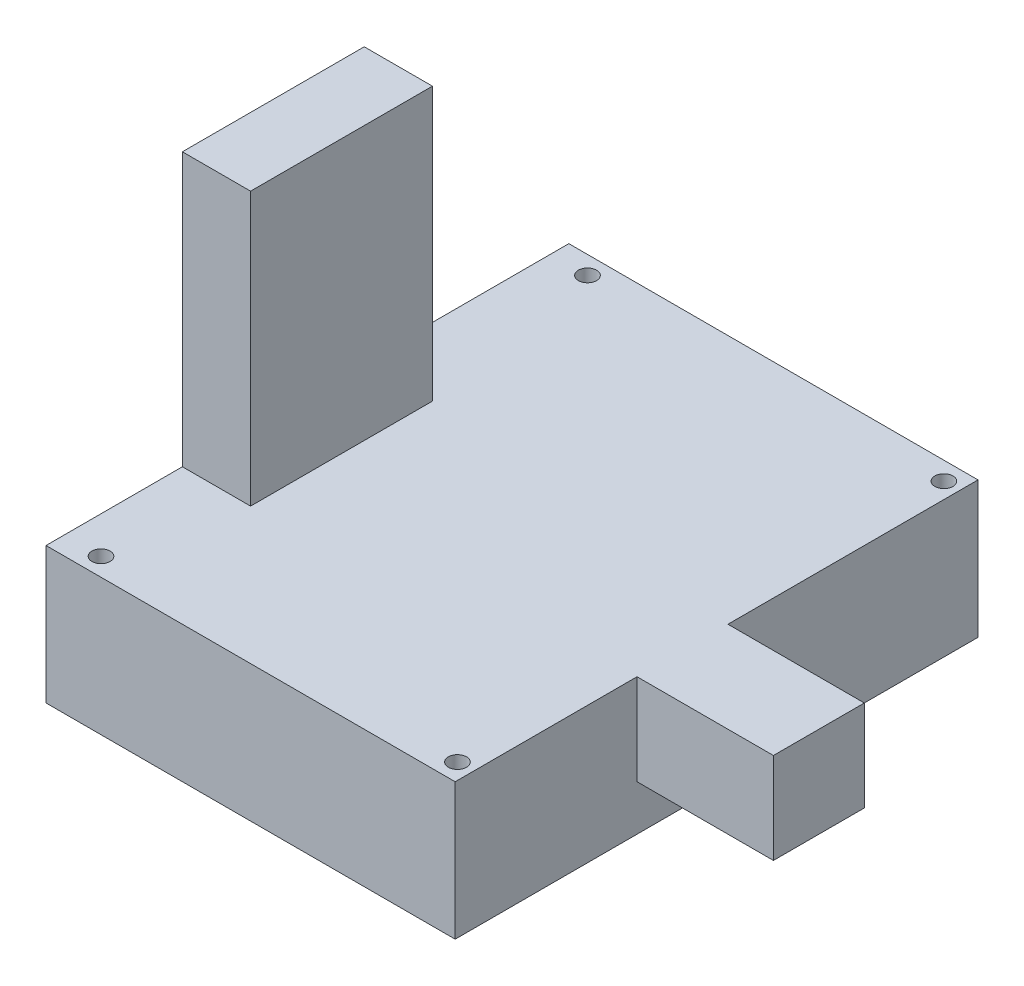
ISO-10303-21;
HEADER;
FILE_DESCRIPTION(('STEP AP214'),'2;1');
FILE_NAME('part.step','',(''),(''),'','','');
FILE_SCHEMA(('AUTOMOTIVE_DESIGN { 1 0 10303 214 1 1 1 1 }'));
ENDSEC;
DATA;
#1=APPLICATION_CONTEXT('core data for automotive mechanical design processes');
#2=APPLICATION_PROTOCOL_DEFINITION('international standard','automotive_design',2000,#1);
#3=PRODUCT_CONTEXT('',#1,'mechanical');
#4=PRODUCT('Part','Part','',(#3));
#5=PRODUCT_RELATED_PRODUCT_CATEGORY('part','',(#4));
#6=PRODUCT_DEFINITION_FORMATION('','',#4);
#7=PRODUCT_DEFINITION_CONTEXT('part definition',#1,'design');
#8=PRODUCT_DEFINITION('design','',#6,#7);
#9=PRODUCT_DEFINITION_SHAPE('','',#8);
#10=(LENGTH_UNIT() NAMED_UNIT(*) SI_UNIT(.MILLI.,.METRE.));
#11=(NAMED_UNIT(*) PLANE_ANGLE_UNIT() SI_UNIT($,.RADIAN.));
#12=(NAMED_UNIT(*) SI_UNIT($,.STERADIAN.) SOLID_ANGLE_UNIT());
#13=UNCERTAINTY_MEASURE_WITH_UNIT(LENGTH_MEASURE(1.E-05),#10,'distance_accuracy_value','');
#14=(GEOMETRIC_REPRESENTATION_CONTEXT(3) GLOBAL_UNCERTAINTY_ASSIGNED_CONTEXT((#13)) GLOBAL_UNIT_ASSIGNED_CONTEXT((#10,
#11,#12)) REPRESENTATION_CONTEXT('',''));
#15=CARTESIAN_POINT('',(0.,0.,0.));
#16=DIRECTION('',(0.,0.,1.));
#17=DIRECTION('',(1.,0.,0.));
#18=AXIS2_PLACEMENT_3D('',#15,#16,#17);
#19=CARTESIAN_POINT('',(-45.,30.,115.));
#20=DIRECTION('',(0.,-1.,0.));
#21=DIRECTION('',(1.,0.,0.));
#22=AXIS2_PLACEMENT_3D('',#19,#20,#21);
#23=PLANE('',#22);
#24=CARTESIAN_POINT('',(41.5,30.,111.));
#25=DIRECTION('',(0.,-1.,0.));
#26=DIRECTION('',(1.,0.,0.));
#27=AXIS2_PLACEMENT_3D('',#24,#25,#26);
#28=CIRCLE('',#27,2.);
#29=CARTESIAN_POINT('',(43.5,30.,111.));
#30=VERTEX_POINT('',#29);
#31=EDGE_CURVE('E268',#30,#30,#28,.F.);
#32=ORIENTED_EDGE('',*,*,#31,.F.);
#33=EDGE_LOOP('',(#32));
#34=FACE_BOUND('',#33,.T.);
#35=CARTESIAN_POINT('',(-36.9,30.,111.));
#36=DIRECTION('',(0.,-1.,0.));
#37=DIRECTION('',(1.,0.,0.));
#38=AXIS2_PLACEMENT_3D('',#35,#36,#37);
#39=CIRCLE('',#38,2.);
#40=CARTESIAN_POINT('',(-34.9,30.,111.));
#41=VERTEX_POINT('',#40);
#42=EDGE_CURVE('E275',#41,#41,#39,.F.);
#43=ORIENTED_EDGE('',*,*,#42,.F.);
#44=EDGE_LOOP('',(#43));
#45=FACE_BOUND('',#44,.T.);
#46=CARTESIAN_POINT('',(-36.9,30.,4.));
#47=DIRECTION('',(0.,-1.,0.));
#48=DIRECTION('',(1.,0.,0.));
#49=AXIS2_PLACEMENT_3D('',#46,#47,#48);
#50=CIRCLE('',#49,2.);
#51=CARTESIAN_POINT('',(-34.9,30.,4.));
#52=VERTEX_POINT('',#51);
#53=EDGE_CURVE('E279',#52,#52,#50,.F.);
#54=ORIENTED_EDGE('',*,*,#53,.F.);
#55=EDGE_LOOP('',(#54));
#56=FACE_BOUND('',#55,.T.);
#57=CARTESIAN_POINT('',(41.5,30.,4.));
#58=DIRECTION('',(0.,-1.,0.));
#59=DIRECTION('',(1.,0.,0.));
#60=AXIS2_PLACEMENT_3D('',#57,#58,#59);
#61=CIRCLE('',#60,1.99999999999998);
#62=CARTESIAN_POINT('',(43.5,30.,4.));
#63=VERTEX_POINT('',#62);
#64=EDGE_CURVE('E283',#63,#63,#61,.F.);
#65=ORIENTED_EDGE('',*,*,#64,.F.);
#66=EDGE_LOOP('',(#65));
#67=FACE_BOUND('',#66,.T.);
#68=DIRECTION('',(-1.,0.,0.));
#69=VECTOR('',#68,1.);
#70=CARTESIAN_POINT('',(-45.,30.,45.));
#71=LINE('',#70,#69);
#72=CARTESIAN_POINT('',(-30.,30.,45.));
#73=VERTEX_POINT('',#72);
#74=CARTESIAN_POINT('',(-45.,30.,45.));
#75=VERTEX_POINT('',#74);
#76=EDGE_CURVE('E54',#73,#75,#71,.T.);
#77=ORIENTED_EDGE('',*,*,#76,.F.);
#78=DIRECTION('',(0.,0.,-1.));
#79=VECTOR('',#78,1.);
#80=CARTESIAN_POINT('',(-30.,30.,45.));
#81=LINE('',#80,#79);
#82=CARTESIAN_POINT('',(-30.,30.,85.));
#83=VERTEX_POINT('',#82);
#84=EDGE_CURVE('E263',#83,#73,#81,.T.);
#85=ORIENTED_EDGE('',*,*,#84,.F.);
#86=DIRECTION('',(1.,0.,0.));
#87=VECTOR('',#86,1.);
#88=CARTESIAN_POINT('',(-45.,30.,85.));
#89=LINE('',#88,#87);
#90=CARTESIAN_POINT('',(-45.,30.,85.));
#91=VERTEX_POINT('',#90);
#92=EDGE_CURVE('E266',#91,#83,#89,.T.);
#93=ORIENTED_EDGE('',*,*,#92,.F.);
#94=DIRECTION('',(0.,0.,-1.));
#95=VECTOR('',#94,1.);
#96=CARTESIAN_POINT('',(-45.,30.,115.));
#97=LINE('',#96,#95);
#98=CARTESIAN_POINT('',(-45.,30.,115.));
#99=VERTEX_POINT('',#98);
#100=EDGE_CURVE('E153',#99,#91,#97,.T.);
#101=ORIENTED_EDGE('',*,*,#100,.F.);
#102=DIRECTION('',(-1.,0.,0.));
#103=VECTOR('',#102,1.);
#104=CARTESIAN_POINT('',(-45.,30.,115.));
#105=LINE('',#104,#103);
#106=CARTESIAN_POINT('',(45.,30.,115.));
#107=VERTEX_POINT('',#106);
#108=EDGE_CURVE('E214',#107,#99,#105,.T.);
#109=ORIENTED_EDGE('',*,*,#108,.F.);
#110=DIRECTION('',(0.,0.,-1.));
#111=VECTOR('',#110,1.);
#112=CARTESIAN_POINT('',(45.,30.,115.));
#113=LINE('',#112,#111);
#114=CARTESIAN_POINT('',(45.,30.,75.));
#115=VERTEX_POINT('',#114);
#116=EDGE_CURVE('E231',#107,#115,#113,.T.);
#117=ORIENTED_EDGE('',*,*,#116,.T.);
#118=DIRECTION('',(-1.,0.,0.));
#119=VECTOR('',#118,1.);
#120=CARTESIAN_POINT('',(75.,30.,75.));
#121=LINE('',#120,#119);
#122=CARTESIAN_POINT('',(75.,30.,75.));
#123=VERTEX_POINT('',#122);
#124=EDGE_CURVE('E179',#123,#115,#121,.T.);
#125=ORIENTED_EDGE('',*,*,#124,.F.);
#126=DIRECTION('',(0.,0.,1.));
#127=VECTOR('',#126,1.);
#128=CARTESIAN_POINT('',(75.,30.,75.));
#129=LINE('',#128,#127);
#130=CARTESIAN_POINT('',(75.,30.,55.));
#131=VERTEX_POINT('',#130);
#132=EDGE_CURVE('E177',#131,#123,#129,.T.);
#133=ORIENTED_EDGE('',*,*,#132,.F.);
#134=DIRECTION('',(-1.,0.,0.));
#135=VECTOR('',#134,1.);
#136=CARTESIAN_POINT('',(75.,30.,55.));
#137=LINE('',#136,#135);
#138=CARTESIAN_POINT('',(45.,30.,55.));
#139=VERTEX_POINT('',#138);
#140=EDGE_CURVE('E190',#131,#139,#137,.T.);
#141=ORIENTED_EDGE('',*,*,#140,.T.);
#142=CARTESIAN_POINT('',(45.,30.,0.));
#143=VERTEX_POINT('',#142);
#144=EDGE_CURVE('E230',#139,#143,#113,.T.);
#145=ORIENTED_EDGE('',*,*,#144,.T.);
#146=DIRECTION('',(-1.,0.,0.));
#147=VECTOR('',#146,1.);
#148=CARTESIAN_POINT('',(-45.,30.,0.));
#149=LINE('',#148,#147);
#150=CARTESIAN_POINT('',(-45.,30.,0.));
#151=VERTEX_POINT('',#150);
#152=EDGE_CURVE('E208',#143,#151,#149,.T.);
#153=ORIENTED_EDGE('',*,*,#152,.T.);
#154=EDGE_CURVE('E59',#75,#151,#97,.T.);
#155=ORIENTED_EDGE('',*,*,#154,.F.);
#156=EDGE_LOOP('',(#77,#85,#93,#101,#109,#117,#125,#133,#141,#145,#153,#155));
#157=FACE_BOUND('',#156,.T.);
#158=ADVANCED_FACE('F38',(#34,#45,#56,#67,#157),#23,.F.);
#159=CARTESIAN_POINT('',(45.,30.,115.));
#160=DIRECTION('',(-1.,0.,0.));
#161=DIRECTION('',(0.,0.,1.));
#162=AXIS2_PLACEMENT_3D('',#159,#160,#161);
#163=PLANE('',#162);
#164=DIRECTION('',(0.,-1.,0.));
#165=VECTOR('',#164,1.);
#166=CARTESIAN_POINT('',(45.,30.,75.));
#167=LINE('',#166,#165);
#168=CARTESIAN_POINT('',(45.,10.,75.));
#169=VERTEX_POINT('',#168);
#170=EDGE_CURVE('E155',#115,#169,#167,.T.);
#171=ORIENTED_EDGE('',*,*,#170,.F.);
#172=ORIENTED_EDGE('',*,*,#116,.F.);
#173=DIRECTION('',(0.,1.,0.));
#174=VECTOR('',#173,1.);
#175=CARTESIAN_POINT('',(45.,30.,115.));
#176=LINE('',#175,#174);
#177=CARTESIAN_POINT('',(45.,0.,115.));
#178=VERTEX_POINT('',#177);
#179=EDGE_CURVE('E211',#178,#107,#176,.T.);
#180=ORIENTED_EDGE('',*,*,#179,.F.);
#181=DIRECTION('',(0.,0.,-1.));
#182=VECTOR('',#181,1.);
#183=CARTESIAN_POINT('',(45.,0.,115.));
#184=LINE('',#183,#182);
#185=CARTESIAN_POINT('',(45.,0.,0.));
#186=VERTEX_POINT('',#185);
#187=EDGE_CURVE('E47',#178,#186,#184,.T.);
#188=ORIENTED_EDGE('',*,*,#187,.T.);
#189=DIRECTION('',(0.,1.,0.));
#190=VECTOR('',#189,1.);
#191=CARTESIAN_POINT('',(45.,30.,0.));
#192=LINE('',#191,#190);
#193=EDGE_CURVE('E222',#186,#143,#192,.T.);
#194=ORIENTED_EDGE('',*,*,#193,.T.);
#195=ORIENTED_EDGE('',*,*,#144,.F.);
#196=DIRECTION('',(0.,1.,0.));
#197=VECTOR('',#196,1.);
#198=CARTESIAN_POINT('',(45.,30.,55.));
#199=LINE('',#198,#197);
#200=CARTESIAN_POINT('',(45.,9.99999999999999,55.));
#201=VERTEX_POINT('',#200);
#202=EDGE_CURVE('E171',#201,#139,#199,.T.);
#203=ORIENTED_EDGE('',*,*,#202,.F.);
#204=DIRECTION('',(0.,0.,-1.));
#205=VECTOR('',#204,1.);
#206=CARTESIAN_POINT('',(45.,10.,75.));
#207=LINE('',#206,#205);
#208=EDGE_CURVE('E160',#169,#201,#207,.T.);
#209=ORIENTED_EDGE('',*,*,#208,.F.);
#210=EDGE_LOOP('',(#171,#172,#180,#188,#194,#195,#203,#209));
#211=FACE_BOUND('',#210,.T.);
#212=ADVANCED_FACE('F240',(#211),#163,.F.);
#213=CARTESIAN_POINT('',(-45.,30.,115.));
#214=DIRECTION('',(1.,0.,0.));
#215=DIRECTION('',(0.,0.,-1.));
#216=AXIS2_PLACEMENT_3D('',#213,#214,#215);
#217=PLANE('',#216);
#218=DIRECTION('',(0.,-1.,0.));
#219=VECTOR('',#218,1.);
#220=CARTESIAN_POINT('',(-45.,30.,0.));
#221=LINE('',#220,#219);
#222=CARTESIAN_POINT('',(-45.,0.,0.));
#223=VERTEX_POINT('',#222);
#224=EDGE_CURVE('E202',#151,#223,#221,.T.);
#225=ORIENTED_EDGE('',*,*,#224,.T.);
#226=DIRECTION('',(0.,0.,-1.));
#227=VECTOR('',#226,1.);
#228=CARTESIAN_POINT('',(-45.,0.,115.));
#229=LINE('',#228,#227);
#230=CARTESIAN_POINT('',(-45.,0.,115.));
#231=VERTEX_POINT('',#230);
#232=EDGE_CURVE('E11',#231,#223,#229,.T.);
#233=ORIENTED_EDGE('',*,*,#232,.F.);
#234=DIRECTION('',(0.,-1.,0.));
#235=VECTOR('',#234,1.);
#236=CARTESIAN_POINT('',(-45.,30.,115.));
#237=LINE('',#236,#235);
#238=EDGE_CURVE('E203',#99,#231,#237,.T.);
#239=ORIENTED_EDGE('',*,*,#238,.F.);
#240=ORIENTED_EDGE('',*,*,#100,.T.);
#241=DIRECTION('',(0.,-1.,0.));
#242=VECTOR('',#241,1.);
#243=CARTESIAN_POINT('',(-45.,90.,85.));
#244=LINE('',#243,#242);
#245=CARTESIAN_POINT('',(-45.,90.,85.));
#246=VERTEX_POINT('',#245);
#247=EDGE_CURVE('E131',#246,#91,#244,.T.);
#248=ORIENTED_EDGE('',*,*,#247,.F.);
#249=DIRECTION('',(0.,0.,1.));
#250=VECTOR('',#249,1.);
#251=CARTESIAN_POINT('',(-45.,90.,45.));
#252=LINE('',#251,#250);
#253=CARTESIAN_POINT('',(-45.,90.,45.));
#254=VERTEX_POINT('',#253);
#255=EDGE_CURVE('E138',#254,#246,#252,.T.);
#256=ORIENTED_EDGE('',*,*,#255,.F.);
#257=DIRECTION('',(0.,-1.,0.));
#258=VECTOR('',#257,1.);
#259=CARTESIAN_POINT('',(-45.,90.,45.));
#260=LINE('',#259,#258);
#261=EDGE_CURVE('E252',#254,#75,#260,.T.);
#262=ORIENTED_EDGE('',*,*,#261,.T.);
#263=ORIENTED_EDGE('',*,*,#154,.T.);
#264=EDGE_LOOP('',(#225,#233,#239,#240,#248,#256,#262,#263));
#265=FACE_BOUND('',#264,.T.);
#266=ADVANCED_FACE('F40',(#265),#217,.F.);
#267=CARTESIAN_POINT('',(-45.,0.,115.));
#268=DIRECTION('',(0.,1.,0.));
#269=DIRECTION('',(0.,0.,1.));
#270=AXIS2_PLACEMENT_3D('',#267,#268,#269);
#271=PLANE('',#270);
#272=CARTESIAN_POINT('',(41.5,0.,111.));
#273=DIRECTION('',(0.,1.,0.));
#274=DIRECTION('',(0.,0.,1.));
#275=AXIS2_PLACEMENT_3D('',#272,#273,#274);
#276=CIRCLE('',#275,2.);
#277=CARTESIAN_POINT('',(41.5,0.,113.));
#278=VERTEX_POINT('',#277);
#279=EDGE_CURVE('E292',#278,#278,#276,.T.);
#280=ORIENTED_EDGE('',*,*,#279,.T.);
#281=EDGE_LOOP('',(#280));
#282=FACE_BOUND('',#281,.T.);
#283=CARTESIAN_POINT('',(-36.9,0.,111.));
#284=DIRECTION('',(0.,1.,0.));
#285=DIRECTION('',(0.,0.,1.));
#286=AXIS2_PLACEMENT_3D('',#283,#284,#285);
#287=CIRCLE('',#286,2.);
#288=CARTESIAN_POINT('',(-36.9,0.,113.));
#289=VERTEX_POINT('',#288);
#290=EDGE_CURVE('E296',#289,#289,#287,.T.);
#291=ORIENTED_EDGE('',*,*,#290,.T.);
#292=EDGE_LOOP('',(#291));
#293=FACE_BOUND('',#292,.T.);
#294=CARTESIAN_POINT('',(-36.9,0.,4.));
#295=DIRECTION('',(0.,1.,0.));
#296=DIRECTION('',(0.,0.,1.));
#297=AXIS2_PLACEMENT_3D('',#294,#295,#296);
#298=CIRCLE('',#297,2.);
#299=CARTESIAN_POINT('',(-36.9,0.,6.00000000000001));
#300=VERTEX_POINT('',#299);
#301=EDGE_CURVE('E291',#300,#300,#298,.T.);
#302=ORIENTED_EDGE('',*,*,#301,.T.);
#303=EDGE_LOOP('',(#302));
#304=FACE_BOUND('',#303,.T.);
#305=CARTESIAN_POINT('',(41.5,0.,4.));
#306=DIRECTION('',(0.,1.,0.));
#307=DIRECTION('',(0.,0.,1.));
#308=AXIS2_PLACEMENT_3D('',#305,#306,#307);
#309=CIRCLE('',#308,1.99999999999998);
#310=CARTESIAN_POINT('',(41.5,0.,5.99999999999999));
#311=VERTEX_POINT('',#310);
#312=EDGE_CURVE('E287',#311,#311,#309,.T.);
#313=ORIENTED_EDGE('',*,*,#312,.T.);
#314=EDGE_LOOP('',(#313));
#315=FACE_BOUND('',#314,.T.);
#316=DIRECTION('',(1.,0.,0.));
#317=VECTOR('',#316,1.);
#318=CARTESIAN_POINT('',(-45.,0.,0.));
#319=LINE('',#318,#317);
#320=EDGE_CURVE('E219',#223,#186,#319,.T.);
#321=ORIENTED_EDGE('',*,*,#320,.T.);
#322=ORIENTED_EDGE('',*,*,#187,.F.);
#323=DIRECTION('',(1.,0.,0.));
#324=VECTOR('',#323,1.);
#325=CARTESIAN_POINT('',(-45.,0.,115.));
#326=LINE('',#325,#324);
#327=EDGE_CURVE('E207',#231,#178,#326,.T.);
#328=ORIENTED_EDGE('',*,*,#327,.F.);
#329=ORIENTED_EDGE('',*,*,#232,.T.);
#330=EDGE_LOOP('',(#321,#322,#328,#329));
#331=FACE_BOUND('',#330,.T.);
#332=ADVANCED_FACE('F304',(#282,#293,#304,#315,#331),#271,.F.);
#333=CARTESIAN_POINT('',(0.,0.,115.));
#334=DIRECTION('',(0.,0.,1.));
#335=DIRECTION('',(1.,0.,0.));
#336=AXIS2_PLACEMENT_3D('',#333,#334,#335);
#337=PLANE('',#336);
#338=ORIENTED_EDGE('',*,*,#238,.T.);
#339=ORIENTED_EDGE('',*,*,#327,.T.);
#340=ORIENTED_EDGE('',*,*,#179,.T.);
#341=ORIENTED_EDGE('',*,*,#108,.T.);
#342=EDGE_LOOP('',(#338,#339,#340,#341));
#343=FACE_BOUND('',#342,.T.);
#344=ADVANCED_FACE('F358',(#343),#337,.T.);
#345=CARTESIAN_POINT('',(0.,0.,0.));
#346=DIRECTION('',(0.,0.,1.));
#347=DIRECTION('',(1.,0.,0.));
#348=AXIS2_PLACEMENT_3D('',#345,#346,#347);
#349=PLANE('',#348);
#350=ORIENTED_EDGE('',*,*,#224,.F.);
#351=ORIENTED_EDGE('',*,*,#152,.F.);
#352=ORIENTED_EDGE('',*,*,#193,.F.);
#353=ORIENTED_EDGE('',*,*,#320,.F.);
#354=EDGE_LOOP('',(#350,#351,#352,#353));
#355=FACE_BOUND('',#354,.T.);
#356=ADVANCED_FACE('F246',(#355),#349,.F.);
#357=CARTESIAN_POINT('',(75.,30.,75.));
#358=DIRECTION('',(0.,0.,-1.));
#359=DIRECTION('',(-1.,0.,0.));
#360=AXIS2_PLACEMENT_3D('',#357,#358,#359);
#361=PLANE('',#360);
#362=ORIENTED_EDGE('',*,*,#170,.T.);
#363=DIRECTION('',(-1.,0.,0.));
#364=VECTOR('',#363,1.);
#365=CARTESIAN_POINT('',(75.,10.,75.));
#366=LINE('',#365,#364);
#367=CARTESIAN_POINT('',(75.,10.,75.));
#368=VERTEX_POINT('',#367);
#369=EDGE_CURVE('E198',#368,#169,#366,.T.);
#370=ORIENTED_EDGE('',*,*,#369,.F.);
#371=DIRECTION('',(0.,-1.,0.));
#372=VECTOR('',#371,1.);
#373=CARTESIAN_POINT('',(75.,30.,75.));
#374=LINE('',#373,#372);
#375=EDGE_CURVE('E166',#123,#368,#374,.T.);
#376=ORIENTED_EDGE('',*,*,#375,.F.);
#377=ORIENTED_EDGE('',*,*,#124,.T.);
#378=EDGE_LOOP('',(#362,#370,#376,#377));
#379=FACE_BOUND('',#378,.T.);
#380=ADVANCED_FACE('F353',(#379),#361,.F.);
#381=CARTESIAN_POINT('',(75.,10.,75.));
#382=DIRECTION('',(0.,1.,0.));
#383=DIRECTION('',(0.,0.,1.));
#384=AXIS2_PLACEMENT_3D('',#381,#382,#383);
#385=PLANE('',#384);
#386=ORIENTED_EDGE('',*,*,#208,.T.);
#387=DIRECTION('',(-1.,0.,0.));
#388=VECTOR('',#387,1.);
#389=CARTESIAN_POINT('',(75.,9.99999999999999,55.));
#390=LINE('',#389,#388);
#391=CARTESIAN_POINT('',(75.,9.99999999999999,55.));
#392=VERTEX_POINT('',#391);
#393=EDGE_CURVE('E194',#392,#201,#390,.T.);
#394=ORIENTED_EDGE('',*,*,#393,.F.);
#395=DIRECTION('',(0.,0.,-1.));
#396=VECTOR('',#395,1.);
#397=CARTESIAN_POINT('',(75.,10.,75.));
#398=LINE('',#397,#396);
#399=EDGE_CURVE('E170',#368,#392,#398,.T.);
#400=ORIENTED_EDGE('',*,*,#399,.F.);
#401=ORIENTED_EDGE('',*,*,#369,.T.);
#402=EDGE_LOOP('',(#386,#394,#400,#401));
#403=FACE_BOUND('',#402,.T.);
#404=ADVANCED_FACE('F349',(#403),#385,.F.);
#405=CARTESIAN_POINT('',(75.,30.,55.));
#406=DIRECTION('',(0.,0.,1.));
#407=DIRECTION('',(0.,-1.,0.));
#408=AXIS2_PLACEMENT_3D('',#405,#406,#407);
#409=PLANE('',#408);
#410=ORIENTED_EDGE('',*,*,#202,.T.);
#411=ORIENTED_EDGE('',*,*,#140,.F.);
#412=DIRECTION('',(0.,1.,0.));
#413=VECTOR('',#412,1.);
#414=CARTESIAN_POINT('',(75.,30.,55.));
#415=LINE('',#414,#413);
#416=EDGE_CURVE('E174',#392,#131,#415,.T.);
#417=ORIENTED_EDGE('',*,*,#416,.F.);
#418=ORIENTED_EDGE('',*,*,#393,.T.);
#419=EDGE_LOOP('',(#410,#411,#417,#418));
#420=FACE_BOUND('',#419,.T.);
#421=ADVANCED_FACE('F345',(#420),#409,.F.);
#422=CARTESIAN_POINT('',(75.,0.,0.));
#423=DIRECTION('',(1.,0.,0.));
#424=DIRECTION('',(0.,0.,-1.));
#425=AXIS2_PLACEMENT_3D('',#422,#423,#424);
#426=PLANE('',#425);
#427=ORIENTED_EDGE('',*,*,#375,.T.);
#428=ORIENTED_EDGE('',*,*,#399,.T.);
#429=ORIENTED_EDGE('',*,*,#416,.T.);
#430=ORIENTED_EDGE('',*,*,#132,.T.);
#431=EDGE_LOOP('',(#427,#428,#429,#430));
#432=FACE_BOUND('',#431,.T.);
#433=ADVANCED_FACE('F342',(#432),#426,.T.);
#434=CARTESIAN_POINT('',(-45.,90.,85.));
#435=DIRECTION('',(0.,0.,-1.));
#436=DIRECTION('',(-1.,0.,0.));
#437=AXIS2_PLACEMENT_3D('',#434,#435,#436);
#438=PLANE('',#437);
#439=ORIENTED_EDGE('',*,*,#92,.T.);
#440=DIRECTION('',(0.,-1.,0.));
#441=VECTOR('',#440,1.);
#442=CARTESIAN_POINT('',(-30.,90.,85.));
#443=LINE('',#442,#441);
#444=CARTESIAN_POINT('',(-30.,90.,85.));
#445=VERTEX_POINT('',#444);
#446=EDGE_CURVE('E133',#445,#83,#443,.T.);
#447=ORIENTED_EDGE('',*,*,#446,.F.);
#448=DIRECTION('',(1.,0.,0.));
#449=VECTOR('',#448,1.);
#450=CARTESIAN_POINT('',(-45.,90.,85.));
#451=LINE('',#450,#449);
#452=EDGE_CURVE('E126',#246,#445,#451,.T.);
#453=ORIENTED_EDGE('',*,*,#452,.F.);
#454=ORIENTED_EDGE('',*,*,#247,.T.);
#455=EDGE_LOOP('',(#439,#447,#453,#454));
#456=FACE_BOUND('',#455,.T.);
#457=ADVANCED_FACE('F129',(#456),#438,.F.);
#458=CARTESIAN_POINT('',(-30.,90.,45.));
#459=DIRECTION('',(-1.,0.,0.));
#460=DIRECTION('',(0.,0.,1.));
#461=AXIS2_PLACEMENT_3D('',#458,#459,#460);
#462=PLANE('',#461);
#463=ORIENTED_EDGE('',*,*,#84,.T.);
#464=DIRECTION('',(0.,-1.,0.));
#465=VECTOR('',#464,1.);
#466=CARTESIAN_POINT('',(-30.,90.,45.));
#467=LINE('',#466,#465);
#468=CARTESIAN_POINT('',(-30.,90.,45.));
#469=VERTEX_POINT('',#468);
#470=EDGE_CURVE('E162',#469,#73,#467,.T.);
#471=ORIENTED_EDGE('',*,*,#470,.F.);
#472=DIRECTION('',(0.,0.,-1.));
#473=VECTOR('',#472,1.);
#474=CARTESIAN_POINT('',(-30.,90.,45.));
#475=LINE('',#474,#473);
#476=EDGE_CURVE('E137',#445,#469,#475,.T.);
#477=ORIENTED_EDGE('',*,*,#476,.F.);
#478=ORIENTED_EDGE('',*,*,#446,.T.);
#479=EDGE_LOOP('',(#463,#471,#477,#478));
#480=FACE_BOUND('',#479,.T.);
#481=ADVANCED_FACE('F336',(#480),#462,.F.);
#482=CARTESIAN_POINT('',(-45.,90.,45.));
#483=DIRECTION('',(0.,0.,1.));
#484=DIRECTION('',(1.,0.,0.));
#485=AXIS2_PLACEMENT_3D('',#482,#483,#484);
#486=PLANE('',#485);
#487=ORIENTED_EDGE('',*,*,#76,.T.);
#488=ORIENTED_EDGE('',*,*,#261,.F.);
#489=DIRECTION('',(-1.,0.,0.));
#490=VECTOR('',#489,1.);
#491=CARTESIAN_POINT('',(-45.,90.,45.));
#492=LINE('',#491,#490);
#493=EDGE_CURVE('E143',#469,#254,#492,.T.);
#494=ORIENTED_EDGE('',*,*,#493,.F.);
#495=ORIENTED_EDGE('',*,*,#470,.T.);
#496=EDGE_LOOP('',(#487,#488,#494,#495));
#497=FACE_BOUND('',#496,.T.);
#498=ADVANCED_FACE('F327',(#497),#486,.F.);
#499=CARTESIAN_POINT('',(0.,90.,0.));
#500=DIRECTION('',(0.,1.,0.));
#501=DIRECTION('',(0.,0.,1.));
#502=AXIS2_PLACEMENT_3D('',#499,#500,#501);
#503=PLANE('',#502);
#504=ORIENTED_EDGE('',*,*,#255,.T.);
#505=ORIENTED_EDGE('',*,*,#452,.T.);
#506=ORIENTED_EDGE('',*,*,#476,.T.);
#507=ORIENTED_EDGE('',*,*,#493,.T.);
#508=EDGE_LOOP('',(#504,#505,#506,#507));
#509=FACE_BOUND('',#508,.T.);
#510=ADVANCED_FACE('F141',(#509),#503,.T.);
#511=CARTESIAN_POINT('',(41.5,54.,4.));
#512=DIRECTION('',(0.,-1.,0.));
#513=DIRECTION('',(0.,0.,-1.));
#514=AXIS2_PLACEMENT_3D('',#511,#512,#513);
#515=CYLINDRICAL_SURFACE('',#514,1.99999999999998);
#516=ORIENTED_EDGE('',*,*,#312,.F.);
#517=EDGE_LOOP('',(#516));
#518=FACE_BOUND('',#517,.T.);
#519=ORIENTED_EDGE('',*,*,#64,.T.);
#520=EDGE_LOOP('',(#519));
#521=FACE_BOUND('',#520,.T.);
#522=ADVANCED_FACE('F311',(#518,#521),#515,.F.);
#523=CARTESIAN_POINT('',(-36.9,54.,4.));
#524=DIRECTION('',(0.,-1.,0.));
#525=DIRECTION('',(0.,0.,-1.));
#526=AXIS2_PLACEMENT_3D('',#523,#524,#525);
#527=CYLINDRICAL_SURFACE('',#526,2.);
#528=ORIENTED_EDGE('',*,*,#301,.F.);
#529=EDGE_LOOP('',(#528));
#530=FACE_BOUND('',#529,.T.);
#531=ORIENTED_EDGE('',*,*,#53,.T.);
#532=EDGE_LOOP('',(#531));
#533=FACE_BOUND('',#532,.T.);
#534=ADVANCED_FACE('F307',(#530,#533),#527,.F.);
#535=CARTESIAN_POINT('',(-36.9,54.,111.));
#536=DIRECTION('',(0.,-1.,0.));
#537=DIRECTION('',(0.,0.,-1.));
#538=AXIS2_PLACEMENT_3D('',#535,#536,#537);
#539=CYLINDRICAL_SURFACE('',#538,2.);
#540=ORIENTED_EDGE('',*,*,#290,.F.);
#541=EDGE_LOOP('',(#540));
#542=FACE_BOUND('',#541,.T.);
#543=ORIENTED_EDGE('',*,*,#42,.T.);
#544=EDGE_LOOP('',(#543));
#545=FACE_BOUND('',#544,.T.);
#546=ADVANCED_FACE('F310',(#542,#545),#539,.F.);
#547=CARTESIAN_POINT('',(41.5,54.,111.));
#548=DIRECTION('',(0.,-1.,0.));
#549=DIRECTION('',(0.,0.,-1.));
#550=AXIS2_PLACEMENT_3D('',#547,#548,#549);
#551=CYLINDRICAL_SURFACE('',#550,2.);
#552=ORIENTED_EDGE('',*,*,#279,.F.);
#553=EDGE_LOOP('',(#552));
#554=FACE_BOUND('',#553,.T.);
#555=ORIENTED_EDGE('',*,*,#31,.T.);
#556=EDGE_LOOP('',(#555));
#557=FACE_BOUND('',#556,.T.);
#558=ADVANCED_FACE('F331',(#554,#557),#551,.F.);
#559=CLOSED_SHELL('',(#158,#212,#266,#332,#344,#356,#380,#404,#421,#433,#457,#481,#498,#510,
#522,#534,#546,#558));
#560=MANIFOLD_SOLID_BREP('B2',#559);
#561=ADVANCED_BREP_SHAPE_REPRESENTATION('',(#18,#560),#14);
#562=SHAPE_DEFINITION_REPRESENTATION(#9,#561);
ENDSEC;
END-ISO-10303-21;
